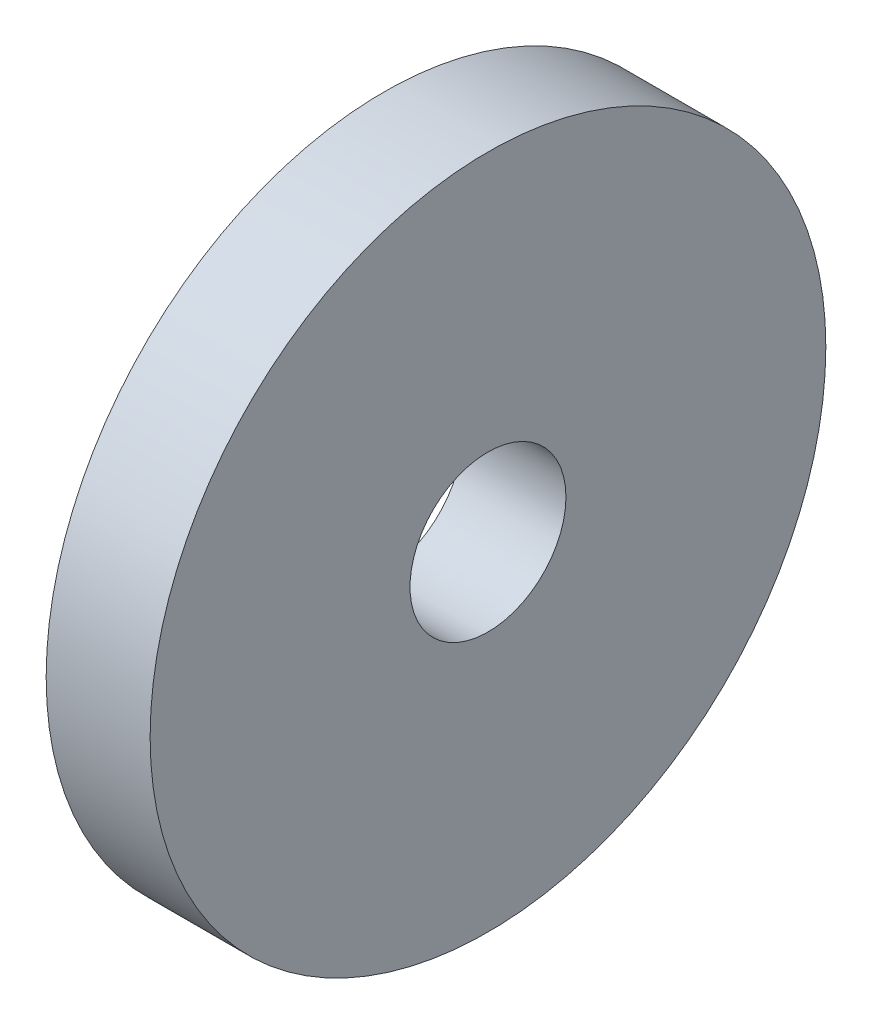
ISO-10303-21;
HEADER;
FILE_DESCRIPTION(('STEP AP214'),'2;1');
FILE_NAME('part.step','',(''),(''),'','','');
FILE_SCHEMA(('AUTOMOTIVE_DESIGN { 1 0 10303 214 1 1 1 1 }'));
ENDSEC;
DATA;
#1=APPLICATION_CONTEXT('core data for automotive mechanical design processes');
#2=APPLICATION_PROTOCOL_DEFINITION('international standard','automotive_design',2000,#1);
#3=PRODUCT_CONTEXT('',#1,'mechanical');
#4=PRODUCT('Part','Part','',(#3));
#5=PRODUCT_RELATED_PRODUCT_CATEGORY('part','',(#4));
#6=PRODUCT_DEFINITION_FORMATION('','',#4);
#7=PRODUCT_DEFINITION_CONTEXT('part definition',#1,'design');
#8=PRODUCT_DEFINITION('design','',#6,#7);
#9=PRODUCT_DEFINITION_SHAPE('','',#8);
#10=(LENGTH_UNIT() NAMED_UNIT(*) SI_UNIT(.MILLI.,.METRE.));
#11=(NAMED_UNIT(*) PLANE_ANGLE_UNIT() SI_UNIT($,.RADIAN.));
#12=(NAMED_UNIT(*) SI_UNIT($,.STERADIAN.) SOLID_ANGLE_UNIT());
#13=UNCERTAINTY_MEASURE_WITH_UNIT(LENGTH_MEASURE(1.E-05),#10,'distance_accuracy_value','');
#14=(GEOMETRIC_REPRESENTATION_CONTEXT(3) GLOBAL_UNCERTAINTY_ASSIGNED_CONTEXT((#13)) GLOBAL_UNIT_ASSIGNED_CONTEXT((#10,
#11,#12)) REPRESENTATION_CONTEXT('',''));
#15=CARTESIAN_POINT('',(0.,0.,0.));
#16=DIRECTION('',(0.,0.,1.));
#17=DIRECTION('',(1.,0.,0.));
#18=AXIS2_PLACEMENT_3D('',#15,#16,#17);
#19=CARTESIAN_POINT('',(2.,0.,0.));
#20=DIRECTION('',(1.,0.,0.));
#21=DIRECTION('',(0.,0.,-1.));
#22=AXIS2_PLACEMENT_3D('',#19,#20,#21);
#23=PLANE('',#22);
#24=CARTESIAN_POINT('',(2.,0.,0.));
#25=DIRECTION('',(1.,0.,0.));
#26=DIRECTION('',(0.,0.,-1.));
#27=AXIS2_PLACEMENT_3D('',#24,#25,#26);
#28=CIRCLE('',#27,6.5);
#29=CARTESIAN_POINT('',(2.,0.,-6.5));
#30=VERTEX_POINT('',#29);
#31=EDGE_CURVE('E10',#30,#30,#28,.T.);
#32=ORIENTED_EDGE('',*,*,#31,.T.);
#33=EDGE_LOOP('',(#32));
#34=FACE_BOUND('',#33,.T.);
#35=CARTESIAN_POINT('',(2.,0.,0.));
#36=DIRECTION('',(1.,0.,0.));
#37=DIRECTION('',(0.,0.,-1.));
#38=AXIS2_PLACEMENT_3D('',#35,#36,#37);
#39=CIRCLE('',#38,1.5);
#40=CARTESIAN_POINT('',(2.,0.,-1.5));
#41=VERTEX_POINT('',#40);
#42=EDGE_CURVE('E42',#41,#41,#39,.T.);
#43=ORIENTED_EDGE('',*,*,#42,.F.);
#44=EDGE_LOOP('',(#43));
#45=FACE_BOUND('',#44,.T.);
#46=ADVANCED_FACE('F31',(#34,#45),#23,.T.);
#47=CARTESIAN_POINT('',(0.,0.,0.));
#48=DIRECTION('',(1.,0.,0.));
#49=DIRECTION('',(0.,0.,-1.));
#50=AXIS2_PLACEMENT_3D('',#47,#48,#49);
#51=PLANE('',#50);
#52=CARTESIAN_POINT('',(0.,0.,0.));
#53=DIRECTION('',(1.,0.,0.));
#54=DIRECTION('',(0.,0.,-1.));
#55=AXIS2_PLACEMENT_3D('',#52,#53,#54);
#56=CIRCLE('',#55,6.5);
#57=CARTESIAN_POINT('',(0.,0.,-6.5));
#58=VERTEX_POINT('',#57);
#59=EDGE_CURVE('E35',#58,#58,#56,.T.);
#60=ORIENTED_EDGE('',*,*,#59,.F.);
#61=EDGE_LOOP('',(#60));
#62=FACE_BOUND('',#61,.T.);
#63=CARTESIAN_POINT('',(0.,0.,0.));
#64=DIRECTION('',(1.,0.,0.));
#65=DIRECTION('',(0.,0.,-1.));
#66=AXIS2_PLACEMENT_3D('',#63,#64,#65);
#67=CIRCLE('',#66,1.5);
#68=CARTESIAN_POINT('',(0.,0.,-1.5));
#69=VERTEX_POINT('',#68);
#70=EDGE_CURVE('E44',#69,#69,#67,.T.);
#71=ORIENTED_EDGE('',*,*,#70,.T.);
#72=EDGE_LOOP('',(#71));
#73=FACE_BOUND('',#72,.T.);
#74=ADVANCED_FACE('F54',(#62,#73),#51,.F.);
#75=CARTESIAN_POINT('',(2.,0.,0.));
#76=DIRECTION('',(-1.,0.,0.));
#77=DIRECTION('',(0.,0.,1.));
#78=AXIS2_PLACEMENT_3D('',#75,#76,#77);
#79=CYLINDRICAL_SURFACE('',#78,6.5);
#80=ORIENTED_EDGE('',*,*,#31,.F.);
#81=EDGE_LOOP('',(#80));
#82=FACE_BOUND('',#81,.T.);
#83=ORIENTED_EDGE('',*,*,#59,.T.);
#84=EDGE_LOOP('',(#83));
#85=FACE_BOUND('',#84,.T.);
#86=ADVANCED_FACE('F33',(#82,#85),#79,.T.);
#87=CARTESIAN_POINT('',(2.,0.,0.));
#88=DIRECTION('',(-1.,0.,0.));
#89=DIRECTION('',(0.,0.,1.));
#90=AXIS2_PLACEMENT_3D('',#87,#88,#89);
#91=CYLINDRICAL_SURFACE('',#90,1.5);
#92=ORIENTED_EDGE('',*,*,#42,.T.);
#93=EDGE_LOOP('',(#92));
#94=FACE_BOUND('',#93,.T.);
#95=ORIENTED_EDGE('',*,*,#70,.F.);
#96=EDGE_LOOP('',(#95));
#97=FACE_BOUND('',#96,.T.);
#98=ADVANCED_FACE('F50',(#94,#97),#91,.F.);
#99=CLOSED_SHELL('',(#46,#74,#86,#98));
#100=MANIFOLD_SOLID_BREP('B2',#99);
#101=ADVANCED_BREP_SHAPE_REPRESENTATION('',(#18,#100),#14);
#102=SHAPE_DEFINITION_REPRESENTATION(#9,#101);
ENDSEC;
END-ISO-10303-21;
